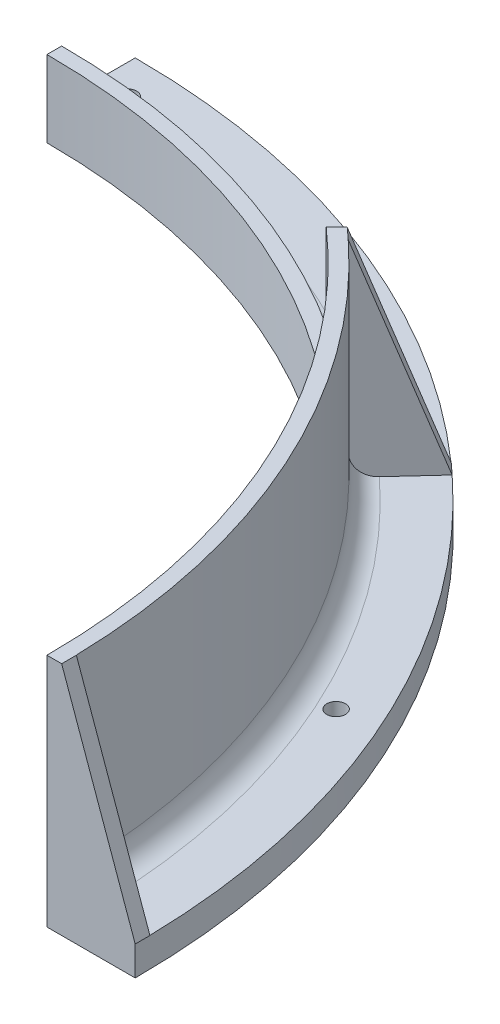
ISO-10303-21;
HEADER;
FILE_DESCRIPTION(('STEP AP214'),'2;1');
FILE_NAME('part.step','',(''),(''),'','','');
FILE_SCHEMA(('AUTOMOTIVE_DESIGN { 1 0 10303 214 1 1 1 1 }'));
ENDSEC;
DATA;
#1=APPLICATION_CONTEXT('core data for automotive mechanical design processes');
#2=APPLICATION_PROTOCOL_DEFINITION('international standard','automotive_design',2000,#1);
#3=PRODUCT_CONTEXT('',#1,'mechanical');
#4=PRODUCT('Part','Part','',(#3));
#5=PRODUCT_RELATED_PRODUCT_CATEGORY('part','',(#4));
#6=PRODUCT_DEFINITION_FORMATION('','',#4);
#7=PRODUCT_DEFINITION_CONTEXT('part definition',#1,'design');
#8=PRODUCT_DEFINITION('design','',#6,#7);
#9=PRODUCT_DEFINITION_SHAPE('','',#8);
#10=(LENGTH_UNIT() NAMED_UNIT(*) SI_UNIT(.MILLI.,.METRE.));
#11=(NAMED_UNIT(*) PLANE_ANGLE_UNIT() SI_UNIT($,.RADIAN.));
#12=(NAMED_UNIT(*) SI_UNIT($,.STERADIAN.) SOLID_ANGLE_UNIT());
#13=UNCERTAINTY_MEASURE_WITH_UNIT(LENGTH_MEASURE(1.E-05),#10,'distance_accuracy_value','');
#14=(GEOMETRIC_REPRESENTATION_CONTEXT(3) GLOBAL_UNCERTAINTY_ASSIGNED_CONTEXT((#13)) GLOBAL_UNIT_ASSIGNED_CONTEXT((#10,
#11,#12)) REPRESENTATION_CONTEXT('',''));
#15=CARTESIAN_POINT('',(0.,0.,0.));
#16=DIRECTION('',(0.,0.,1.));
#17=DIRECTION('',(1.,0.,0.));
#18=AXIS2_PLACEMENT_3D('',#15,#16,#17);
#19=CARTESIAN_POINT('',(0.,6.35,0.));
#20=DIRECTION('',(0.,1.,0.));
#21=DIRECTION('',(0.,0.,-1.));
#22=AXIS2_PLACEMENT_3D('',#19,#20,#21);
#23=PLANE('',#22);
#24=CARTESIAN_POINT('',(87.8582584127768,6.35,-130.923309608808));
#25=DIRECTION('',(0.,-1.,0.));
#26=DIRECTION('',(0.,0.,-1.));
#27=AXIS2_PLACEMENT_3D('',#24,#25,#26);
#28=CIRCLE('',#27,2.0193);
#29=CARTESIAN_POINT('',(87.8582584127768,6.35,-132.942609608808));
#30=VERTEX_POINT('',#29);
#31=EDGE_CURVE('E227',#30,#30,#28,.T.);
#32=ORIENTED_EDGE('',*,*,#31,.T.);
#33=EDGE_LOOP('',(#32));
#34=FACE_BOUND('',#33,.T.);
#35=CARTESIAN_POINT('',(6.35,6.35,-157.542578594645));
#36=DIRECTION('',(0.,-1.,0.));
#37=DIRECTION('',(0.,0.,-1.));
#38=AXIS2_PLACEMENT_3D('',#35,#36,#37);
#39=CIRCLE('',#38,2.0193);
#40=CARTESIAN_POINT('',(6.35,6.35,-159.561878594645));
#41=VERTEX_POINT('',#40);
#42=EDGE_CURVE('E221',#41,#41,#39,.T.);
#43=ORIENTED_EDGE('',*,*,#42,.T.);
#44=EDGE_LOOP('',(#43));
#45=FACE_BOUND('',#44,.T.);
#46=DIRECTION('',(-0.677197088183268,0.,0.735801674200395));
#47=VECTOR('',#46,1.);
#48=CARTESIAN_POINT('',(96.9124805343771,6.35,-109.987722522443));
#49=LINE('',#48,#47);
#50=CARTESIAN_POINT('',(109.792472541622,6.35,-123.982348087126));
#51=VERTEX_POINT('',#50);
#52=CARTESIAN_POINT('',(102.265636985971,6.35,-115.80414073816));
#53=VERTEX_POINT('',#52);
#54=EDGE_CURVE('E393',#51,#53,#49,.T.);
#55=ORIENTED_EDGE('',*,*,#54,.F.);
#56=CARTESIAN_POINT('',(0.,6.35,0.));
#57=DIRECTION('',(0.,-1.,0.));
#58=DIRECTION('',(0.,0.,-1.));
#59=AXIS2_PLACEMENT_3D('',#56,#57,#58);
#60=CIRCLE('',#59,165.608);
#61=CARTESIAN_POINT('',(0.,6.35,-165.608));
#62=VERTEX_POINT('',#61);
#63=EDGE_CURVE('E269',#62,#51,#60,.T.);
#64=ORIENTED_EDGE('',*,*,#63,.F.);
#65=DIRECTION('',(0.,0.,-1.));
#66=VECTOR('',#65,1.);
#67=CARTESIAN_POINT('',(0.,6.35,-165.608));
#68=LINE('',#67,#66);
#69=CARTESIAN_POINT('',(0.,6.35,-154.4955));
#70=VERTEX_POINT('',#69);
#71=EDGE_CURVE('E272',#70,#62,#68,.T.);
#72=ORIENTED_EDGE('',*,*,#71,.F.);
#73=CARTESIAN_POINT('',(0.,6.35,0.));
#74=DIRECTION('',(0.,-1.,0.));
#75=DIRECTION('',(0.,0.,-1.));
#76=AXIS2_PLACEMENT_3D('',#73,#74,#75);
#77=CIRCLE('',#76,154.4955);
#78=EDGE_CURVE('E59',#53,#70,#77,.F.);
#79=ORIENTED_EDGE('',*,*,#78,.F.);
#80=EDGE_LOOP('',(#55,#64,#72,#79));
#81=FACE_BOUND('',#80,.T.);
#82=ADVANCED_FACE('F50',(#34,#45,#81),#23,.T.);
#83=CARTESIAN_POINT('',(0.,50.8,0.));
#84=DIRECTION('',(0.,-1.,0.));
#85=DIRECTION('',(0.,0.,1.));
#86=AXIS2_PLACEMENT_3D('',#83,#84,#85);
#87=CYLINDRICAL_SURFACE('',#86,149.733);
#88=DIRECTION('',(0.,-1.,0.));
#89=VECTOR('',#88,1.);
#90=CARTESIAN_POINT('',(0.,50.8,-149.733));
#91=LINE('',#90,#89);
#92=CARTESIAN_POINT('',(1.5477176260627E-12,16.51,-149.733));
#93=VERTEX_POINT('',#92);
#94=CARTESIAN_POINT('',(0.,11.1125,-149.733));
#95=VERTEX_POINT('',#94);
#96=EDGE_CURVE('E266',#93,#95,#91,.T.);
#97=ORIENTED_EDGE('',*,*,#96,.F.);
#98=CARTESIAN_POINT('',(0.,16.51,0.));
#99=DIRECTION('',(0.,-1.,0.));
#100=DIRECTION('',(0.,0.,-1.));
#101=AXIS2_PLACEMENT_3D('',#98,#99,#100);
#102=CIRCLE('',#101,149.733);
#103=CARTESIAN_POINT('',(98.9275867482955,16.51,-112.397970929899));
#104=VERTEX_POINT('',#103);
#105=EDGE_CURVE('E240',#104,#93,#102,.F.);
#106=ORIENTED_EDGE('',*,*,#105,.F.);
#107=DIRECTION('',(0.,1.,0.));
#108=VECTOR('',#107,1.);
#109=CARTESIAN_POINT('',(98.9275867482955,-100.203365637243,-112.397970929899));
#110=LINE('',#109,#108);
#111=CARTESIAN_POINT('',(98.9275867482955,50.8,-112.397970929899));
#112=VERTEX_POINT('',#111);
#113=EDGE_CURVE('E251',#104,#112,#110,.T.);
#114=ORIENTED_EDGE('',*,*,#113,.T.);
#115=CARTESIAN_POINT('',(0.,50.8,0.));
#116=DIRECTION('',(0.,-1.,0.));
#117=DIRECTION('',(0.,0.,-1.));
#118=AXIS2_PLACEMENT_3D('',#115,#116,#117);
#119=CIRCLE('',#118,149.733);
#120=CARTESIAN_POINT('',(99.0397829168485,50.8,-112.299121496045));
#121=VERTEX_POINT('',#120);
#122=EDGE_CURVE('E261',#112,#121,#119,.T.);
#123=ORIENTED_EDGE('',*,*,#122,.T.);
#124=DIRECTION('',(0.,-1.,0.));
#125=VECTOR('',#124,1.);
#126=CARTESIAN_POINT('',(99.0397829168485,50.8,-112.299121496045));
#127=LINE('',#126,#125);
#128=CARTESIAN_POINT('',(99.0397829168485,11.1125,-112.299121496045));
#129=VERTEX_POINT('',#128);
#130=EDGE_CURVE('E178',#121,#129,#127,.T.);
#131=ORIENTED_EDGE('',*,*,#130,.T.);
#132=CARTESIAN_POINT('',(0.,11.1125,0.));
#133=DIRECTION('',(0.,-1.,0.));
#134=DIRECTION('',(0.,0.,-1.));
#135=AXIS2_PLACEMENT_3D('',#132,#133,#134);
#136=CIRCLE('',#135,149.733);
#137=EDGE_CURVE('E412',#95,#129,#136,.T.);
#138=ORIENTED_EDGE('',*,*,#137,.F.);
#139=EDGE_LOOP('',(#97,#106,#114,#123,#131,#138));
#140=FACE_BOUND('',#139,.T.);
#141=ADVANCED_FACE('F341',(#140),#87,.T.);
#142=DIRECTION('',(-1.,0.,0.));
#143=VECTOR('',#142,1.);
#144=CARTESIAN_POINT('',(146.558,6.35,-3.17499999999998));
#145=LINE('',#144,#143);
#146=CARTESIAN_POINT('',(165.577562003431,6.35,-3.17499999999998));
#147=VERTEX_POINT('',#146);
#148=CARTESIAN_POINT('',(154.462872222583,6.35,-3.17499999999998));
#149=VERTEX_POINT('',#148);
#150=EDGE_CURVE('E203',#147,#149,#145,.T.);
#151=ORIENTED_EDGE('',*,*,#150,.F.);
#152=CARTESIAN_POINT('',(112.149255379855,6.35,-121.854643660979));
#153=VERTEX_POINT('',#152);
#154=EDGE_CURVE('E273',#153,#147,#60,.T.);
#155=ORIENTED_EDGE('',*,*,#154,.F.);
#156=DIRECTION('',(-0.677197088183268,0.,0.735801674200395));
#157=VECTOR('',#156,1.);
#158=CARTESIAN_POINT('',(99.2486508499633,6.35,-107.837621767461));
#159=LINE('',#158,#157);
#160=CARTESIAN_POINT('',(104.623902737418,6.35,-113.678047556427));
#161=VERTEX_POINT('',#160);
#162=EDGE_CURVE('E397',#153,#161,#159,.T.);
#163=ORIENTED_EDGE('',*,*,#162,.T.);
#164=CARTESIAN_POINT('',(0.,6.35,0.));
#165=DIRECTION('',(0.,-1.,0.));
#166=DIRECTION('',(0.,0.,-1.));
#167=AXIS2_PLACEMENT_3D('',#164,#165,#166);
#168=CIRCLE('',#167,154.4955);
#169=EDGE_CURVE('E307',#149,#161,#168,.F.);
#170=ORIENTED_EDGE('',*,*,#169,.F.);
#171=EDGE_LOOP('',(#151,#155,#163,#170));
#172=FACE_BOUND('',#171,.T.);
#173=CARTESIAN_POINT('',(143.383000088422,6.35,-65.5843110499279));
#174=DIRECTION('',(0.,-1.,0.));
#175=DIRECTION('',(0.,0.,-1.));
#176=AXIS2_PLACEMENT_3D('',#173,#174,#175);
#177=CIRCLE('',#176,2.0193);
#178=CARTESIAN_POINT('',(143.383000088422,6.35,-67.6036110499279));
#179=VERTEX_POINT('',#178);
#180=EDGE_CURVE('E233',#179,#179,#177,.T.);
#181=ORIENTED_EDGE('',*,*,#180,.T.);
#182=EDGE_LOOP('',(#181));
#183=FACE_BOUND('',#182,.T.);
#184=ADVANCED_FACE('F338',(#172,#183),#23,.T.);
#185=DIRECTION('',(0.,-1.,0.));
#186=VECTOR('',#185,1.);
#187=CARTESIAN_POINT('',(101.398751604945,50.8,-110.173792083048));
#188=LINE('',#187,#186);
#189=CARTESIAN_POINT('',(101.398751604945,50.8,-110.173792083048));
#190=VERTEX_POINT('',#189);
#191=CARTESIAN_POINT('',(101.398751604945,11.1125,-110.173792083048));
#192=VERTEX_POINT('',#191);
#193=EDGE_CURVE('E189',#190,#192,#188,.T.);
#194=ORIENTED_EDGE('',*,*,#193,.F.);
#195=CARTESIAN_POINT('',(149.699334213616,50.8,-3.17499999999998));
#196=VERTEX_POINT('',#195);
#197=EDGE_CURVE('E186',#190,#196,#119,.T.);
#198=ORIENTED_EDGE('',*,*,#197,.T.);
#199=DIRECTION('',(0.,-1.,0.));
#200=VECTOR('',#199,1.);
#201=CARTESIAN_POINT('',(149.699334213616,50.8,-3.17499999999998));
#202=LINE('',#201,#200);
#203=CARTESIAN_POINT('',(149.699334213616,11.1125,-3.17499999999998));
#204=VERTEX_POINT('',#203);
#205=EDGE_CURVE('E214',#196,#204,#202,.T.);
#206=ORIENTED_EDGE('',*,*,#205,.T.);
#207=CARTESIAN_POINT('',(0.,11.1125,0.));
#208=DIRECTION('',(0.,-1.,0.));
#209=DIRECTION('',(0.,0.,-1.));
#210=AXIS2_PLACEMENT_3D('',#207,#208,#209);
#211=CIRCLE('',#210,149.733);
#212=EDGE_CURVE('E297',#192,#204,#211,.T.);
#213=ORIENTED_EDGE('',*,*,#212,.F.);
#214=EDGE_LOOP('',(#194,#198,#206,#213));
#215=FACE_BOUND('',#214,.T.);
#216=ADVANCED_FACE('F334',(#215),#87,.T.);
#217=CARTESIAN_POINT('',(0.,6.35,-165.608));
#218=DIRECTION('',(1.,0.,0.));
#219=DIRECTION('',(0.,0.,1.));
#220=AXIS2_PLACEMENT_3D('',#217,#218,#219);
#221=PLANE('',#220);
#222=DIRECTION('',(-4.93974779819525E-13,0.,1.));
#223=VECTOR('',#222,1.);
#224=CARTESIAN_POINT('',(0.,16.51,-146.558));
#225=LINE('',#224,#223);
#226=CARTESIAN_POINT('',(0.,16.51,-146.558));
#227=VERTEX_POINT('',#226);
#228=EDGE_CURVE('E249',#93,#227,#225,.T.);
#229=ORIENTED_EDGE('',*,*,#228,.F.);
#230=ORIENTED_EDGE('',*,*,#96,.T.);
#231=CARTESIAN_POINT('',(0.,11.1125,-154.4955));
#232=DIRECTION('',(-1.,0.,0.));
#233=DIRECTION('',(0.,0.,1.));
#234=AXIS2_PLACEMENT_3D('',#231,#232,#233);
#235=CIRCLE('',#234,4.7625);
#236=EDGE_CURVE('E13',#70,#95,#235,.T.);
#237=ORIENTED_EDGE('',*,*,#236,.F.);
#238=ORIENTED_EDGE('',*,*,#71,.T.);
#239=DIRECTION('',(0.,-1.,0.));
#240=VECTOR('',#239,1.);
#241=CARTESIAN_POINT('',(0.,6.35,-165.608));
#242=LINE('',#241,#240);
#243=CARTESIAN_POINT('',(0.,0.,-165.608));
#244=VERTEX_POINT('',#243);
#245=EDGE_CURVE('E275',#62,#244,#242,.T.);
#246=ORIENTED_EDGE('',*,*,#245,.T.);
#247=DIRECTION('',(0.,0.,-1.));
#248=VECTOR('',#247,1.);
#249=CARTESIAN_POINT('',(0.,0.,-165.608));
#250=LINE('',#249,#248);
#251=CARTESIAN_POINT('',(0.,0.,-146.558));
#252=VERTEX_POINT('',#251);
#253=EDGE_CURVE('E283',#252,#244,#250,.T.);
#254=ORIENTED_EDGE('',*,*,#253,.F.);
#255=DIRECTION('',(0.,-1.,0.));
#256=VECTOR('',#255,1.);
#257=CARTESIAN_POINT('',(0.,6.35,-146.558));
#258=LINE('',#257,#256);
#259=EDGE_CURVE('E288',#227,#252,#258,.T.);
#260=ORIENTED_EDGE('',*,*,#259,.F.);
#261=EDGE_LOOP('',(#229,#230,#237,#238,#246,#254,#260));
#262=FACE_BOUND('',#261,.T.);
#263=ADVANCED_FACE('F322',(#262),#221,.F.);
#264=CARTESIAN_POINT('',(0.,6.35,0.));
#265=DIRECTION('',(0.,-1.,0.));
#266=DIRECTION('',(0.,0.,1.));
#267=AXIS2_PLACEMENT_3D('',#264,#265,#266);
#268=CYLINDRICAL_SURFACE('',#267,165.608);
#269=CARTESIAN_POINT('',(0.,0.,0.));
#270=DIRECTION('',(0.,-1.,0.));
#271=DIRECTION('',(0.,0.,-1.));
#272=AXIS2_PLACEMENT_3D('',#269,#270,#271);
#273=CIRCLE('',#272,165.608);
#274=CARTESIAN_POINT('',(165.608,0.,0.));
#275=VERTEX_POINT('',#274);
#276=EDGE_CURVE('E268',#244,#275,#273,.T.);
#277=ORIENTED_EDGE('',*,*,#276,.F.);
#278=ORIENTED_EDGE('',*,*,#245,.F.);
#279=ORIENTED_EDGE('',*,*,#63,.T.);
#280=CARTESIAN_POINT('',(0.,6.35000000000001,0.));
#281=DIRECTION('',(0.,1.,0.));
#282=DIRECTION('',(0.,0.,1.));
#283=AXIS2_PLACEMENT_3D('',#280,#281,#282);
#284=CIRCLE('',#283,165.608);
#285=EDGE_CURVE('E196',#153,#51,#284,.T.);
#286=ORIENTED_EDGE('',*,*,#285,.F.);
#287=ORIENTED_EDGE('',*,*,#154,.T.);
#288=CARTESIAN_POINT('',(0.,6.35000000000001,0.));
#289=DIRECTION('',(0.,1.,0.));
#290=DIRECTION('',(1.,0.,0.));
#291=AXIS2_PLACEMENT_3D('',#288,#289,#290);
#292=CIRCLE('',#291,165.608);
#293=CARTESIAN_POINT('',(165.608,6.35,0.));
#294=VERTEX_POINT('',#293);
#295=EDGE_CURVE('E218',#294,#147,#292,.T.);
#296=ORIENTED_EDGE('',*,*,#295,.F.);
#297=DIRECTION('',(0.,-1.,0.));
#298=VECTOR('',#297,1.);
#299=CARTESIAN_POINT('',(165.608,6.35,0.));
#300=LINE('',#299,#298);
#301=EDGE_CURVE('E294',#294,#275,#300,.T.);
#302=ORIENTED_EDGE('',*,*,#301,.T.);
#303=EDGE_LOOP('',(#277,#278,#279,#286,#287,#296,#302));
#304=FACE_BOUND('',#303,.T.);
#305=ADVANCED_FACE('F318',(#304),#268,.T.);
#306=CARTESIAN_POINT('',(165.608,6.35,0.));
#307=DIRECTION('',(0.,0.,-1.));
#308=DIRECTION('',(1.,0.,0.));
#309=AXIS2_PLACEMENT_3D('',#306,#307,#308);
#310=PLANE('',#309);
#311=DIRECTION('',(-1.,0.,0.));
#312=VECTOR('',#311,1.);
#313=CARTESIAN_POINT('',(165.608,0.,0.));
#314=LINE('',#313,#312);
#315=CARTESIAN_POINT('',(146.558,0.,0.));
#316=VERTEX_POINT('',#315);
#317=EDGE_CURVE('E278',#275,#316,#314,.T.);
#318=ORIENTED_EDGE('',*,*,#317,.F.);
#319=ORIENTED_EDGE('',*,*,#301,.F.);
#320=DIRECTION('',(0.336336396998156,-0.941741911594837,0.));
#321=VECTOR('',#320,1.);
#322=CARTESIAN_POINT('',(165.608,6.35,0.));
#323=LINE('',#322,#321);
#324=CARTESIAN_POINT('',(149.733,50.8,0.));
#325=VERTEX_POINT('',#324);
#326=EDGE_CURVE('E199',#325,#294,#323,.T.);
#327=ORIENTED_EDGE('',*,*,#326,.F.);
#328=DIRECTION('',(-1.,0.,0.));
#329=VECTOR('',#328,1.);
#330=CARTESIAN_POINT('',(146.558,50.8,0.));
#331=LINE('',#330,#329);
#332=CARTESIAN_POINT('',(146.558,50.8,0.));
#333=VERTEX_POINT('',#332);
#334=EDGE_CURVE('E263',#325,#333,#331,.T.);
#335=ORIENTED_EDGE('',*,*,#334,.T.);
#336=DIRECTION('',(0.,-1.,0.));
#337=VECTOR('',#336,1.);
#338=CARTESIAN_POINT('',(146.558,6.35,0.));
#339=LINE('',#338,#337);
#340=EDGE_CURVE('E291',#333,#316,#339,.T.);
#341=ORIENTED_EDGE('',*,*,#340,.T.);
#342=EDGE_LOOP('',(#318,#319,#327,#335,#341));
#343=FACE_BOUND('',#342,.T.);
#344=ADVANCED_FACE('F321',(#343),#310,.F.);
#345=CARTESIAN_POINT('',(0.,6.35,0.));
#346=DIRECTION('',(0.,-1.,0.));
#347=DIRECTION('',(0.,0.,1.));
#348=AXIS2_PLACEMENT_3D('',#345,#346,#347);
#349=CYLINDRICAL_SURFACE('',#348,146.558);
#350=DIRECTION('',(0.,1.,0.));
#351=VECTOR('',#350,1.);
#352=CARTESIAN_POINT('',(96.6778673818779,-100.203365637243,-110.148251563482));
#353=LINE('',#352,#351);
#354=CARTESIAN_POINT('',(96.6778673818779,16.51,-110.148251563482));
#355=VERTEX_POINT('',#354);
#356=CARTESIAN_POINT('',(96.6778673818779,50.8,-110.148251563482));
#357=VERTEX_POINT('',#356);
#358=EDGE_CURVE('E244',#355,#357,#353,.T.);
#359=ORIENTED_EDGE('',*,*,#358,.F.);
#360=CARTESIAN_POINT('',(0.,16.51,0.));
#361=DIRECTION('',(0.,-1.,0.));
#362=DIRECTION('',(0.,0.,-1.));
#363=AXIS2_PLACEMENT_3D('',#360,#361,#362);
#364=CIRCLE('',#363,146.558);
#365=EDGE_CURVE('E246',#227,#355,#364,.T.);
#366=ORIENTED_EDGE('',*,*,#365,.F.);
#367=ORIENTED_EDGE('',*,*,#259,.T.);
#368=CARTESIAN_POINT('',(0.,0.,0.));
#369=DIRECTION('',(0.,1.,0.));
#370=DIRECTION('',(0.,0.,-1.));
#371=AXIS2_PLACEMENT_3D('',#368,#369,#370);
#372=CIRCLE('',#371,146.558);
#373=EDGE_CURVE('E281',#316,#252,#372,.T.);
#374=ORIENTED_EDGE('',*,*,#373,.F.);
#375=ORIENTED_EDGE('',*,*,#340,.F.);
#376=CARTESIAN_POINT('',(0.,50.8,0.));
#377=DIRECTION('',(0.,1.,0.));
#378=DIRECTION('',(0.,0.,-1.));
#379=AXIS2_PLACEMENT_3D('',#376,#377,#378);
#380=CIRCLE('',#379,146.558);
#381=EDGE_CURVE('E258',#333,#357,#380,.T.);
#382=ORIENTED_EDGE('',*,*,#381,.T.);
#383=EDGE_LOOP('',(#359,#366,#367,#374,#375,#382));
#384=FACE_BOUND('',#383,.T.);
#385=ADVANCED_FACE('F326',(#384),#349,.F.);
#386=CARTESIAN_POINT('',(0.,0.,0.));
#387=DIRECTION('',(0.,1.,0.));
#388=DIRECTION('',(0.,0.,-1.));
#389=AXIS2_PLACEMENT_3D('',#386,#387,#388);
#390=PLANE('',#389);
#391=CARTESIAN_POINT('',(6.35,0.,-157.542578594645));
#392=DIRECTION('',(0.,-1.,0.));
#393=DIRECTION('',(0.,0.,-1.));
#394=AXIS2_PLACEMENT_3D('',#391,#392,#393);
#395=CIRCLE('',#394,2.0193);
#396=CARTESIAN_POINT('',(6.35,0.,-159.561878594645));
#397=VERTEX_POINT('',#396);
#398=EDGE_CURVE('E224',#397,#397,#395,.T.);
#399=ORIENTED_EDGE('',*,*,#398,.F.);
#400=EDGE_LOOP('',(#399));
#401=FACE_BOUND('',#400,.T.);
#402=CARTESIAN_POINT('',(87.8582584127768,0.,-130.923309608808));
#403=DIRECTION('',(0.,-1.,0.));
#404=DIRECTION('',(0.,0.,-1.));
#405=AXIS2_PLACEMENT_3D('',#402,#403,#404);
#406=CIRCLE('',#405,2.0193);
#407=CARTESIAN_POINT('',(87.8582584127768,0.,-132.942609608808));
#408=VERTEX_POINT('',#407);
#409=EDGE_CURVE('E230',#408,#408,#406,.T.);
#410=ORIENTED_EDGE('',*,*,#409,.F.);
#411=EDGE_LOOP('',(#410));
#412=FACE_BOUND('',#411,.T.);
#413=CARTESIAN_POINT('',(143.383000088422,0.,-65.5843110499279));
#414=DIRECTION('',(0.,-1.,0.));
#415=DIRECTION('',(0.,0.,-1.));
#416=AXIS2_PLACEMENT_3D('',#413,#414,#415);
#417=CIRCLE('',#416,2.0193);
#418=CARTESIAN_POINT('',(143.383000088422,0.,-67.6036110499279));
#419=VERTEX_POINT('',#418);
#420=EDGE_CURVE('E236',#419,#419,#417,.T.);
#421=ORIENTED_EDGE('',*,*,#420,.F.);
#422=EDGE_LOOP('',(#421));
#423=FACE_BOUND('',#422,.T.);
#424=ORIENTED_EDGE('',*,*,#276,.T.);
#425=ORIENTED_EDGE('',*,*,#317,.T.);
#426=ORIENTED_EDGE('',*,*,#373,.T.);
#427=ORIENTED_EDGE('',*,*,#253,.T.);
#428=EDGE_LOOP('',(#424,#425,#426,#427));
#429=FACE_BOUND('',#428,.T.);
#430=ADVANCED_FACE('F330',(#401,#412,#423,#429),#390,.F.);
#431=CARTESIAN_POINT('',(0.,50.8,0.));
#432=DIRECTION('',(0.,1.,0.));
#433=DIRECTION('',(0.,0.,-1.));
#434=AXIS2_PLACEMENT_3D('',#431,#432,#433);
#435=PLANE('',#434);
#436=ORIENTED_EDGE('',*,*,#381,.F.);
#437=ORIENTED_EDGE('',*,*,#334,.F.);
#438=DIRECTION('',(0.,0.,1.));
#439=VECTOR('',#438,1.);
#440=CARTESIAN_POINT('',(149.733,50.8,-3.17499999999998));
#441=LINE('',#440,#439);
#442=CARTESIAN_POINT('',(149.733,50.8,-3.17499999999998));
#443=VERTEX_POINT('',#442);
#444=EDGE_CURVE('E209',#443,#325,#441,.T.);
#445=ORIENTED_EDGE('',*,*,#444,.F.);
#446=DIRECTION('',(1.,0.,0.));
#447=VECTOR('',#446,1.);
#448=CARTESIAN_POINT('',(149.733,50.8,-3.17499999999998));
#449=LINE('',#448,#447);
#450=EDGE_CURVE('E202',#196,#443,#449,.T.);
#451=ORIENTED_EDGE('',*,*,#450,.F.);
#452=ORIENTED_EDGE('',*,*,#197,.F.);
#453=DIRECTION('',(0.735801674200395,0.,0.677197088183268));
#454=VECTOR('',#453,1.);
#455=CARTESIAN_POINT('',(99.0625812893589,50.8,-112.32389283803));
#456=LINE('',#455,#454);
#457=CARTESIAN_POINT('',(99.0625812893589,50.8,-112.32389283803));
#458=VERTEX_POINT('',#457);
#459=EDGE_CURVE('E167',#458,#190,#456,.T.);
#460=ORIENTED_EDGE('',*,*,#459,.F.);
#461=DIRECTION('',(0.677197088183267,0.,-0.735801674200395));
#462=VECTOR('',#461,1.);
#463=CARTESIAN_POINT('',(99.0625812893589,50.8,-112.32389283803));
#464=LINE('',#463,#462);
#465=EDGE_CURVE('E173',#121,#458,#464,.T.);
#466=ORIENTED_EDGE('',*,*,#465,.F.);
#467=ORIENTED_EDGE('',*,*,#122,.F.);
#468=DIRECTION('',(-0.707106781186547,0.,0.707106781186547));
#469=VECTOR('',#468,1.);
#470=CARTESIAN_POINT('',(96.6778673818779,50.8,-110.148251563482));
#471=LINE('',#470,#469);
#472=EDGE_CURVE('E239',#112,#357,#471,.T.);
#473=ORIENTED_EDGE('',*,*,#472,.T.);
#474=EDGE_LOOP('',(#436,#437,#445,#451,#452,#460,#466,#467,#473));
#475=FACE_BOUND('',#474,.T.);
#476=ADVANCED_FACE('F184',(#475),#435,.T.);
#477=CARTESIAN_POINT('',(96.6778673818779,-100.203365637243,-110.148251563482));
#478=DIRECTION('',(0.707106781186547,0.,0.707106781186547));
#479=DIRECTION('',(-0.707106781186548,0.,0.707106781186548));
#480=AXIS2_PLACEMENT_3D('',#477,#478,#479);
#481=PLANE('',#480);
#482=DIRECTION('',(0.707106781186548,0.,-0.707106781186548));
#483=VECTOR('',#482,1.);
#484=CARTESIAN_POINT('',(96.6778673818779,16.51,-110.148251563482));
#485=LINE('',#484,#483);
#486=EDGE_CURVE('E243',#355,#104,#485,.T.);
#487=ORIENTED_EDGE('',*,*,#486,.F.);
#488=ORIENTED_EDGE('',*,*,#358,.T.);
#489=ORIENTED_EDGE('',*,*,#472,.F.);
#490=ORIENTED_EDGE('',*,*,#113,.F.);
#491=EDGE_LOOP('',(#487,#488,#489,#490));
#492=FACE_BOUND('',#491,.T.);
#493=ADVANCED_FACE('F348',(#492),#481,.F.);
#494=CARTESIAN_POINT('',(0.,16.51,0.));
#495=DIRECTION('',(0.,1.,0.));
#496=DIRECTION('',(0.,0.,-1.));
#497=AXIS2_PLACEMENT_3D('',#494,#495,#496);
#498=PLANE('',#497);
#499=ORIENTED_EDGE('',*,*,#365,.T.);
#500=ORIENTED_EDGE('',*,*,#486,.T.);
#501=ORIENTED_EDGE('',*,*,#105,.T.);
#502=ORIENTED_EDGE('',*,*,#228,.T.);
#503=EDGE_LOOP('',(#499,#500,#501,#502));
#504=FACE_BOUND('',#503,.T.);
#505=ADVANCED_FACE('F351',(#504),#498,.T.);
#506=CARTESIAN_POINT('',(143.383000088422,6.35,-65.5843110499279));
#507=DIRECTION('',(0.,1.,0.));
#508=DIRECTION('',(0.,0.,-1.));
#509=AXIS2_PLACEMENT_3D('',#506,#507,#508);
#510=CYLINDRICAL_SURFACE('',#509,2.0193);
#511=ORIENTED_EDGE('',*,*,#420,.T.);
#512=EDGE_LOOP('',(#511));
#513=FACE_BOUND('',#512,.T.);
#514=ORIENTED_EDGE('',*,*,#180,.F.);
#515=EDGE_LOOP('',(#514));
#516=FACE_BOUND('',#515,.T.);
#517=ADVANCED_FACE('F355',(#513,#516),#510,.F.);
#518=CARTESIAN_POINT('',(87.8582584127768,6.35,-130.923309608808));
#519=DIRECTION('',(0.,1.,0.));
#520=DIRECTION('',(0.,0.,-1.));
#521=AXIS2_PLACEMENT_3D('',#518,#519,#520);
#522=CYLINDRICAL_SURFACE('',#521,2.0193);
#523=ORIENTED_EDGE('',*,*,#409,.T.);
#524=EDGE_LOOP('',(#523));
#525=FACE_BOUND('',#524,.T.);
#526=ORIENTED_EDGE('',*,*,#31,.F.);
#527=EDGE_LOOP('',(#526));
#528=FACE_BOUND('',#527,.T.);
#529=ADVANCED_FACE('F359',(#525,#528),#522,.F.);
#530=CARTESIAN_POINT('',(6.35,6.35,-157.542578594645));
#531=DIRECTION('',(0.,1.,0.));
#532=DIRECTION('',(0.,0.,-1.));
#533=AXIS2_PLACEMENT_3D('',#530,#531,#532);
#534=CYLINDRICAL_SURFACE('',#533,2.0193);
#535=ORIENTED_EDGE('',*,*,#398,.T.);
#536=EDGE_LOOP('',(#535));
#537=FACE_BOUND('',#536,.T.);
#538=ORIENTED_EDGE('',*,*,#42,.F.);
#539=EDGE_LOOP('',(#538));
#540=FACE_BOUND('',#539,.T.);
#541=ADVANCED_FACE('F363',(#537,#540),#534,.F.);
#542=CARTESIAN_POINT('',(0.,0.,-3.175));
#543=DIRECTION('',(0.,0.,1.));
#544=DIRECTION('',(-1.,0.,0.));
#545=AXIS2_PLACEMENT_3D('',#542,#543,#544);
#546=PLANE('',#545);
#547=ORIENTED_EDGE('',*,*,#205,.F.);
#548=ORIENTED_EDGE('',*,*,#450,.T.);
#549=DIRECTION('',(0.336336396998156,-0.941741911594837,0.));
#550=VECTOR('',#549,1.);
#551=CARTESIAN_POINT('',(165.608,6.35,-3.17499999999998));
#552=LINE('',#551,#550);
#553=CARTESIAN_POINT('',(165.608,6.35,-3.17499999999998));
#554=VERTEX_POINT('',#553);
#555=EDGE_CURVE('E206',#443,#554,#552,.T.);
#556=ORIENTED_EDGE('',*,*,#555,.T.);
#557=EDGE_CURVE('E200',#554,#147,#145,.T.);
#558=ORIENTED_EDGE('',*,*,#557,.T.);
#559=ORIENTED_EDGE('',*,*,#150,.T.);
#560=CARTESIAN_POINT('',(149.699334213616,11.1125,-3.17499999999998));
#561=CARTESIAN_POINT('',(149.699319790026,10.9785713474723,-3.17499999999998));
#562=CARTESIAN_POINT('',(149.704984290728,10.8446447738204,-3.17499999999998));
#563=CARTESIAN_POINT('',(149.727566958852,10.5777500118703,-3.17499999999998));
#564=CARTESIAN_POINT('',(149.744484581268,10.4447817774736,-3.17499999999998));
#565=CARTESIAN_POINT('',(149.789452194235,10.180845342274,-3.17499999999998));
#566=CARTESIAN_POINT('',(149.817493693966,10.0498756949536,-3.17499999999998));
#567=CARTESIAN_POINT('',(149.884504798505,9.79076442451655,-3.17499999999998));
#568=CARTESIAN_POINT('',(149.92347427088,9.6626227671486,-3.17499999999998));
#569=CARTESIAN_POINT('',(150.01207879621,9.41003823021002,-3.17499999999998));
#570=CARTESIAN_POINT('',(150.06171704599,9.28559647203891,-3.17499999999998));
#571=CARTESIAN_POINT('',(150.171318971588,9.04129095233959,-3.17499999999998));
#572=CARTESIAN_POINT('',(150.231286457239,8.92142889999107,-3.17499999999998));
#573=CARTESIAN_POINT('',(150.361071980461,8.68724740025125,-3.17499999999998));
#574=CARTESIAN_POINT('',(150.43088464629,8.57292497572293,-3.17499999999998));
#575=CARTESIAN_POINT('',(150.579916165122,8.3505238053961,-3.17499999999998));
#576=CARTESIAN_POINT('',(150.659138473613,8.24244737509791,-3.17499999999998));
#577=CARTESIAN_POINT('',(150.826381743108,8.03338089720746,-3.17499999999998));
#578=CARTESIAN_POINT('',(150.914400246791,7.93238888384371,-3.17499999999998));
#579=CARTESIAN_POINT('',(151.098662981825,7.73813887120709,-3.17499999999998));
#580=CARTESIAN_POINT('',(151.194910264997,7.64488376681986,-3.17499999999998));
#581=CARTESIAN_POINT('',(151.394900962987,7.46682695850519,-3.17499999999998));
#582=CARTESIAN_POINT('',(151.498643117271,7.38202383875333,-3.17499999999998));
#583=CARTESIAN_POINT('',(151.71293843103,7.22142664345269,-3.17499999999998));
#584=CARTESIAN_POINT('',(151.823494000065,7.14563578316689,-3.17499999999998));
#585=CARTESIAN_POINT('',(152.050622789557,7.0036203111652,-3.17499999999998));
#586=CARTESIAN_POINT('',(152.167197369762,6.93739787398899,-3.17499999999998));
#587=CARTESIAN_POINT('',(152.405510672094,6.8150100686132,-3.17499999999998));
#588=CARTESIAN_POINT('',(152.527249417448,6.75884474565247,-3.17499999999998));
#589=CARTESIAN_POINT('',(152.774971733018,6.65699440125483,-3.17499999999998));
#590=CARTESIAN_POINT('',(152.900953243838,6.61130437695837,-3.17499999999998));
#591=CARTESIAN_POINT('',(153.156269589726,6.53070512132488,-3.17499999999998));
#592=CARTESIAN_POINT('',(153.285603689858,6.49579354849726,-3.17499999999998));
#593=CARTESIAN_POINT('',(153.587905987703,6.42772788122996,-3.17499999999998));
#594=CARTESIAN_POINT('',(153.76180259789,6.39858091068646,-3.17499999999998));
#595=CARTESIAN_POINT('',(154.024046891021,6.36943569544182,-3.17499999999998));
#596=CARTESIAN_POINT('',(154.111650916364,6.36214983678776,-3.17499999999998));
#597=CARTESIAN_POINT('',(154.287120176222,6.35243263454373,-3.17499999999998));
#598=CARTESIAN_POINT('',(154.374985387331,6.35000086839031,-3.17499999999998));
#599=CARTESIAN_POINT('',(154.462872222583,6.35,-3.17499999999998));
#600=B_SPLINE_CURVE_WITH_KNOTS('',3,(#560,#561,#562,#563,#564,#565,#566,#567,#568,#569,#570,
#571,#572,#573,#574,#575,#576,#577,#578,#579,#580,#581,#582,#583,#584,#585,#586,#587,#588,#589,
#590,#591,#592,#593,#594,#595,#596,#597,#598,#599),.UNSPECIFIED.,.F.,.F.,(4,2,2,2,2,2,2,2,2,2,2,
2,2,2,2,2,2,2,2,4),(0.,0.401663287730584,0.803307123731037,1.20464497435916,1.60597796150036,
2.00743137334798,2.40903317551841,2.81041669690409,3.2119480761427,3.61336759480087,
4.01493663976958,4.41643830290293,4.81808278090697,5.21981839438181,5.6215558148962,
6.02310096956935,6.42455883184669,6.95229693374402,7.21590359796831,7.47948731343327),.UNSPECIFIED.);
#601=EDGE_CURVE('E300',#204,#149,#600,.T.);
#602=ORIENTED_EDGE('',*,*,#601,.F.);
#603=EDGE_LOOP('',(#547,#548,#556,#558,#559,#602));
#604=FACE_BOUND('',#603,.T.);
#605=ADVANCED_FACE('F309',(#604),#546,.F.);
#606=CARTESIAN_POINT('',(146.558,6.35,-3.17499999999998));
#607=DIRECTION('',(0.,-1.,0.));
#608=DIRECTION('',(1.,0.,0.));
#609=AXIS2_PLACEMENT_3D('',#606,#607,#608);
#610=PLANE('',#609);
#611=ORIENTED_EDGE('',*,*,#295,.T.);
#612=ORIENTED_EDGE('',*,*,#557,.F.);
#613=DIRECTION('',(0.,0.,1.));
#614=VECTOR('',#613,1.);
#615=CARTESIAN_POINT('',(165.608,6.35,-3.17499999999998));
#616=LINE('',#615,#614);
#617=EDGE_CURVE('E212',#554,#294,#616,.T.);
#618=ORIENTED_EDGE('',*,*,#617,.T.);
#619=EDGE_LOOP('',(#611,#612,#618));
#620=FACE_BOUND('',#619,.T.);
#621=ADVANCED_FACE('F368',(#620),#610,.T.);
#622=CARTESIAN_POINT('',(165.608,6.35,-3.17499999999998));
#623=DIRECTION('',(0.941741911594837,0.336336396998156,0.));
#624=DIRECTION('',(-0.336336396998156,0.941741911594837,0.));
#625=AXIS2_PLACEMENT_3D('',#622,#623,#624);
#626=PLANE('',#625);
#627=ORIENTED_EDGE('',*,*,#326,.T.);
#628=ORIENTED_EDGE('',*,*,#617,.F.);
#629=ORIENTED_EDGE('',*,*,#555,.F.);
#630=ORIENTED_EDGE('',*,*,#444,.T.);
#631=EDGE_LOOP('',(#627,#628,#629,#630));
#632=FACE_BOUND('',#631,.T.);
#633=ADVANCED_FACE('F370',(#632),#626,.T.);
#634=CARTESIAN_POINT('',(96.9124805343771,6.35,-109.987722522443));
#635=DIRECTION('',(0.,-1.,0.));
#636=DIRECTION('',(0.,0.,1.));
#637=AXIS2_PLACEMENT_3D('',#634,#635,#636);
#638=PLANE('',#637);
#639=ORIENTED_EDGE('',*,*,#285,.T.);
#640=CARTESIAN_POINT('',(109.813085064268,6.35,-124.004744415961));
#641=VERTEX_POINT('',#640);
#642=EDGE_CURVE('E182',#641,#51,#49,.T.);
#643=ORIENTED_EDGE('',*,*,#642,.F.);
#644=DIRECTION('',(0.735801674200395,0.,0.677197088183268));
#645=VECTOR('',#644,1.);
#646=CARTESIAN_POINT('',(109.813085064268,6.35,-124.004744415961));
#647=LINE('',#646,#645);
#648=EDGE_CURVE('E170',#641,#153,#647,.T.);
#649=ORIENTED_EDGE('',*,*,#648,.T.);
#650=EDGE_LOOP('',(#639,#643,#649));
#651=FACE_BOUND('',#650,.T.);
#652=ADVANCED_FACE('F373',(#651),#638,.T.);
#653=CARTESIAN_POINT('',(-2.33617031558625,0.,-2.15010075498187));
#654=DIRECTION('',(0.735801674200395,0.,0.677197088183268));
#655=DIRECTION('',(-0.677197088183268,0.,0.735801674200395));
#656=AXIS2_PLACEMENT_3D('',#653,#654,#655);
#657=PLANE('',#656);
#658=ORIENTED_EDGE('',*,*,#130,.F.);
#659=ORIENTED_EDGE('',*,*,#465,.T.);
#660=DIRECTION('',(0.227766028697203,-0.941741911594837,-0.247476884005772));
#661=VECTOR('',#660,1.);
#662=CARTESIAN_POINT('',(109.813085064268,6.35,-124.004744415961));
#663=LINE('',#662,#661);
#664=EDGE_CURVE('E163',#458,#641,#663,.T.);
#665=ORIENTED_EDGE('',*,*,#664,.T.);
#666=ORIENTED_EDGE('',*,*,#642,.T.);
#667=ORIENTED_EDGE('',*,*,#54,.T.);
#668=CARTESIAN_POINT('',(99.0397829168485,11.1125,-112.299121496045));
#669=CARTESIAN_POINT('',(99.0397731492351,10.9785713474723,-112.299110883143));
#670=CARTESIAN_POINT('',(99.0436091326165,10.8446447738204,-112.303278832243));
#671=CARTESIAN_POINT('',(99.0589020497133,10.5777500118703,-112.319895197257));
#672=CARTESIAN_POINT('',(99.0703586143526,10.4447817774736,-112.332343212154));
#673=CARTESIAN_POINT('',(99.1008105509166,10.180845342274,-112.36543045706));
#674=CARTESIAN_POINT('',(99.1198001728827,10.0498756949536,-112.386063439509));
#675=CARTESIAN_POINT('',(99.1651798977523,9.79076442451655,-112.435370322419));
#676=CARTESIAN_POINT('',(99.1915699109726,9.66262276714859,-112.464044125435));
#677=CARTESIAN_POINT('',(99.2515726375259,9.41003823021002,-112.529239483515));
#678=CARTESIAN_POINT('',(99.2851875157393,9.28559647203891,-112.565763390807));
#679=CARTESIAN_POINT('',(99.3594096206135,9.04129095233959,-112.646408671157));
#680=CARTESIAN_POINT('',(99.4000194272825,8.92142889999108,-112.690532847498));
#681=CARTESIAN_POINT('',(99.4879098056965,8.68724740025124,-112.786029252771));
#682=CARTESIAN_POINT('',(99.5351867397142,8.5729249757229,-112.837397529168));
#683=CARTESIAN_POINT('',(99.6361104503147,8.35052380539607,-112.947055170234));
#684=CARTESIAN_POINT('',(99.6897595669443,8.2424473750979,-113.005347077456));
#685=CARTESIAN_POINT('',(99.8030162220644,8.03338089720745,-113.128404955149));
#686=CARTESIAN_POINT('',(99.8626220964649,7.93238888384371,-113.193169117519));
#687=CARTESIAN_POINT('',(99.9874042840907,7.73813887120707,-113.32874994645));
#688=CARTESIAN_POINT('',(100.052582664,7.64488376681983,-113.399568858545));
#689=CARTESIAN_POINT('',(100.188015782342,7.46682695850516,-113.54672234895));
#690=CARTESIAN_POINT('',(100.258269667146,7.38202383875331,-113.623055999758));
#691=CARTESIAN_POINT('',(100.403389829635,7.22142664345267,-113.780734850395));
#692=CARTESIAN_POINT('',(100.478257739068,7.14563578316688,-113.862081823184));
#693=CARTESIAN_POINT('',(100.632068693954,7.00362031116518,-114.029203566751));
#694=CARTESIAN_POINT('',(100.711012660225,6.93739787398898,-114.114979338035));
#695=CARTESIAN_POINT('',(100.87239773464,6.8150100686132,-114.290330664875));
#696=CARTESIAN_POINT('',(100.954838858512,6.75884474565248,-114.379906237521));
#697=CARTESIAN_POINT('',(101.122595689295,6.65699440125485,-114.562180732054));
#698=CARTESIAN_POINT('',(101.207910001587,6.61130437695837,-114.654878138634));
#699=CARTESIAN_POINT('',(101.380809487588,6.53070512132488,-114.842740333389));
#700=CARTESIAN_POINT('',(101.4683941636,6.49579354849726,-114.937904580798));
#701=CARTESIAN_POINT('',(101.673112399452,6.42772788122996,-115.160339117667));
#702=CARTESIAN_POINT('',(101.790874677515,6.39858091068646,-115.28829253458));
#703=CARTESIAN_POINT('',(101.968465749216,6.36943569544182,-115.481252324515));
#704=CARTESIAN_POINT('',(102.027790940092,6.36214983678776,-115.54571151303));
#705=CARTESIAN_POINT('',(102.146618211933,6.35243263454374,-115.674822088203));
#706=CARTESIAN_POINT('',(102.206120277049,6.35000086839031,-115.739473457642));
#707=CARTESIAN_POINT('',(102.265636985971,6.35,-115.80414073816));
#708=B_SPLINE_CURVE_WITH_KNOTS('',3,(#668,#669,#670,#671,#672,#673,#674,#675,#676,#677,#678,
#679,#680,#681,#682,#683,#684,#685,#686,#687,#688,#689,#690,#691,#692,#693,#694,#695,#696,#697,
#698,#699,#700,#701,#702,#703,#704,#705,#706,#707),.UNSPECIFIED.,.F.,.F.,(4,2,2,2,2,2,2,2,2,2,2,
2,2,2,2,2,2,2,2,4),(0.,0.401663287730588,0.803307123731042,1.20464497435916,1.60597796150037,
2.00743137334799,2.40903317551841,2.81041669690414,3.21194807614271,3.61336759480089,
4.01493663976962,4.41643830290299,4.81808278090701,5.21981839438184,5.62155581489621,
6.02310096956936,6.42455883184671,6.95229693374403,7.21590359796833,7.47948731343328),.UNSPECIFIED.);
#709=EDGE_CURVE('E71',#129,#53,#708,.T.);
#710=ORIENTED_EDGE('',*,*,#709,.F.);
#711=EDGE_LOOP('',(#658,#659,#665,#666,#667,#710));
#712=FACE_BOUND('',#711,.T.);
#713=ADVANCED_FACE('F176',(#712),#657,.F.);
#714=CARTESIAN_POINT('',(0.,0.,0.));
#715=DIRECTION('',(0.735801674200395,0.,0.677197088183268));
#716=DIRECTION('',(-0.677197088183268,0.,0.735801674200395));
#717=AXIS2_PLACEMENT_3D('',#714,#715,#716);
#718=PLANE('',#717);
#719=ORIENTED_EDGE('',*,*,#162,.F.);
#720=DIRECTION('',(0.227766028697203,-0.941741911594837,-0.247476884005772));
#721=VECTOR('',#720,1.);
#722=CARTESIAN_POINT('',(112.149255379855,6.35,-121.854643660979));
#723=LINE('',#722,#721);
#724=EDGE_CURVE('E395',#190,#153,#723,.T.);
#725=ORIENTED_EDGE('',*,*,#724,.F.);
#726=ORIENTED_EDGE('',*,*,#193,.T.);
#727=CARTESIAN_POINT('',(104.623902737418,11.1125,-113.678047556427));
#728=DIRECTION('',(-0.735801674200395,0.,-0.677197088183268));
#729=DIRECTION('',(-0.677197088183268,0.,0.735801674200395));
#730=AXIS2_PLACEMENT_3D('',#727,#728,#729);
#731=CIRCLE('',#730,4.7625);
#732=EDGE_CURVE('E410',#161,#192,#731,.T.);
#733=ORIENTED_EDGE('',*,*,#732,.F.);
#734=EDGE_LOOP('',(#719,#725,#726,#733));
#735=FACE_BOUND('',#734,.T.);
#736=ADVANCED_FACE('F409',(#735),#718,.T.);
#737=CARTESIAN_POINT('',(109.813085064268,6.35,-124.004744415961));
#738=DIRECTION('',(0.637744880352168,0.336336396998156,-0.692935275216161));
#739=DIRECTION('',(0.735801674200395,0.,0.677197088183268));
#740=AXIS2_PLACEMENT_3D('',#737,#738,#739);
#741=PLANE('',#740);
#742=ORIENTED_EDGE('',*,*,#724,.T.);
#743=ORIENTED_EDGE('',*,*,#648,.F.);
#744=ORIENTED_EDGE('',*,*,#664,.F.);
#745=ORIENTED_EDGE('',*,*,#459,.T.);
#746=EDGE_LOOP('',(#742,#743,#744,#745));
#747=FACE_BOUND('',#746,.T.);
#748=ADVANCED_FACE('F165',(#747),#741,.T.);
#749=CARTESIAN_POINT('',(0.,11.1125,0.));
#750=DIRECTION('',(0.,1.,0.));
#751=DIRECTION('',(0.,0.,-1.));
#752=AXIS2_PLACEMENT_3D('',#749,#750,#751);
#753=TOROIDAL_SURFACE('',#752,154.4955,4.7625);
#754=ORIENTED_EDGE('',*,*,#732,.T.);
#755=ORIENTED_EDGE('',*,*,#212,.T.);
#756=ORIENTED_EDGE('',*,*,#601,.T.);
#757=ORIENTED_EDGE('',*,*,#169,.T.);
#758=EDGE_LOOP('',(#754,#755,#756,#757));
#759=FACE_BOUND('',#758,.T.);
#760=ADVANCED_FACE('F313',(#759),#753,.F.);
#761=CARTESIAN_POINT('',(0.,11.1125,0.));
#762=DIRECTION('',(0.,1.,0.));
#763=DIRECTION('',(0.,0.,-1.));
#764=AXIS2_PLACEMENT_3D('',#761,#762,#763);
#765=TOROIDAL_SURFACE('',#764,154.4955,4.7625);
#766=ORIENTED_EDGE('',*,*,#236,.T.);
#767=ORIENTED_EDGE('',*,*,#137,.T.);
#768=ORIENTED_EDGE('',*,*,#709,.T.);
#769=ORIENTED_EDGE('',*,*,#78,.T.);
#770=EDGE_LOOP('',(#766,#767,#768,#769));
#771=FACE_BOUND('',#770,.T.);
#772=ADVANCED_FACE('F52',(#771),#765,.F.);
#773=CLOSED_SHELL('',(#82,#141,#184,#216,#263,#305,#344,#385,#430,#476,#493,#505,#517,#529,#541,
#605,#621,#633,#652,#713,#736,#748,#760,#772));
#774=MANIFOLD_SOLID_BREP('B2',#773);
#775=ADVANCED_BREP_SHAPE_REPRESENTATION('',(#18,#774),#14);
#776=SHAPE_DEFINITION_REPRESENTATION(#9,#775);
ENDSEC;
END-ISO-10303-21;
